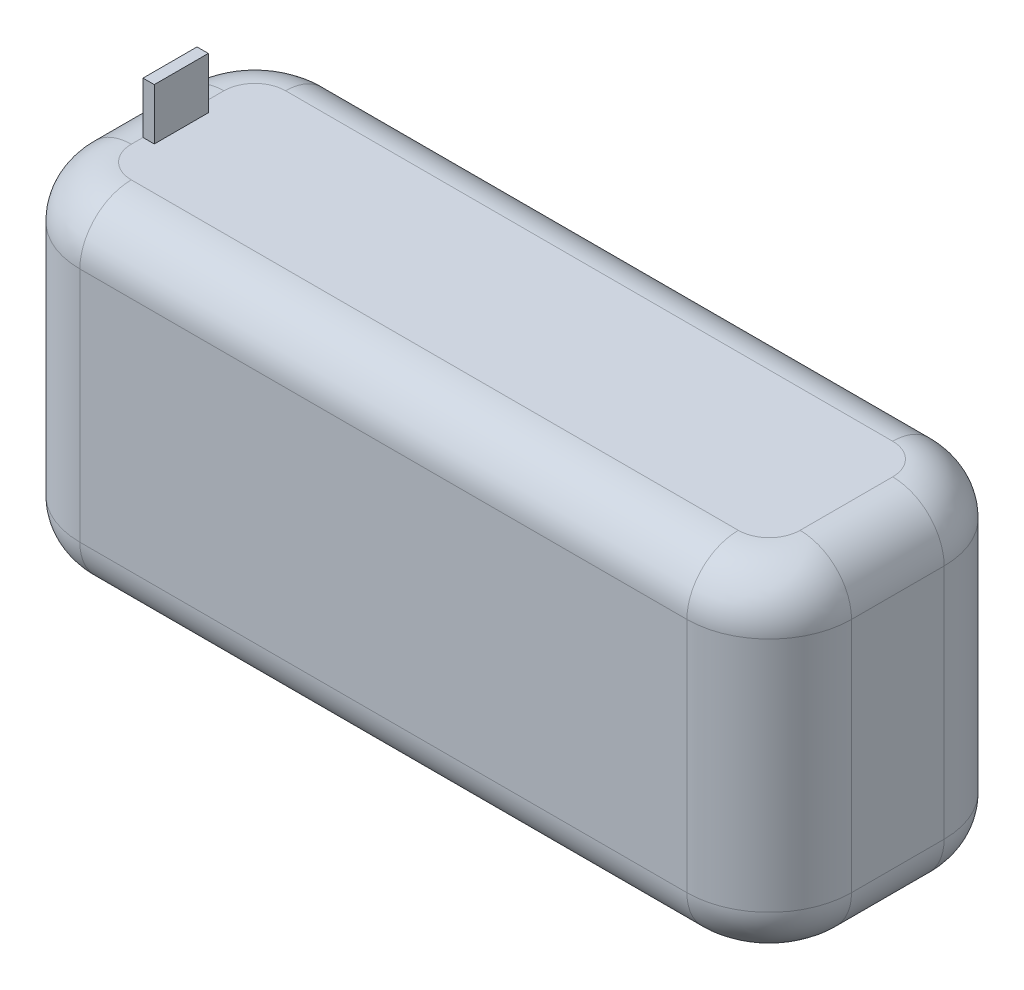
ISO-10303-21;
HEADER;
FILE_DESCRIPTION(('STEP AP214'),'2;1');
FILE_NAME('part.step','',(''),(''),'','','');
FILE_SCHEMA(('AUTOMOTIVE_DESIGN { 1 0 10303 214 1 1 1 1 }'));
ENDSEC;
DATA;
#1=APPLICATION_CONTEXT('core data for automotive mechanical design processes');
#2=APPLICATION_PROTOCOL_DEFINITION('international standard','automotive_design',2000,#1);
#3=PRODUCT_CONTEXT('',#1,'mechanical');
#4=PRODUCT('Part','Part','',(#3));
#5=PRODUCT_RELATED_PRODUCT_CATEGORY('part','',(#4));
#6=PRODUCT_DEFINITION_FORMATION('','',#4);
#7=PRODUCT_DEFINITION_CONTEXT('part definition',#1,'design');
#8=PRODUCT_DEFINITION('design','',#6,#7);
#9=PRODUCT_DEFINITION_SHAPE('','',#8);
#10=(LENGTH_UNIT() NAMED_UNIT(*) SI_UNIT(.MILLI.,.METRE.));
#11=(NAMED_UNIT(*) PLANE_ANGLE_UNIT() SI_UNIT($,.RADIAN.));
#12=(NAMED_UNIT(*) SI_UNIT($,.STERADIAN.) SOLID_ANGLE_UNIT());
#13=UNCERTAINTY_MEASURE_WITH_UNIT(LENGTH_MEASURE(1.E-05),#10,'distance_accuracy_value','');
#14=(GEOMETRIC_REPRESENTATION_CONTEXT(3) GLOBAL_UNCERTAINTY_ASSIGNED_CONTEXT((#13)) GLOBAL_UNIT_ASSIGNED_CONTEXT((#10,
#11,#12)) REPRESENTATION_CONTEXT('',''));
#15=CARTESIAN_POINT('',(0.,0.,0.));
#16=DIRECTION('',(0.,0.,1.));
#17=DIRECTION('',(1.,0.,0.));
#18=AXIS2_PLACEMENT_3D('',#15,#16,#17);
#19=CARTESIAN_POINT('',(-37.5,16.5,25.));
#20=DIRECTION('',(0.,-1.,0.));
#21=DIRECTION('',(0.,0.,-1.));
#22=AXIS2_PLACEMENT_3D('',#19,#20,#21);
#23=PLANE('',#22);
#24=DIRECTION('',(1.,0.,0.));
#25=VECTOR('',#24,1.);
#26=CARTESIAN_POINT('',(-32.5,16.5,15.8667271653457));
#27=LINE('',#26,#25);
#28=CARTESIAN_POINT('',(-32.5,16.5,15.8667271653457));
#29=VERTEX_POINT('',#28);
#30=CARTESIAN_POINT('',(-31.4033614629352,16.5,15.8667271653457));
#31=VERTEX_POINT('',#30);
#32=EDGE_CURVE('E849',#29,#31,#27,.T.);
#33=ORIENTED_EDGE('',*,*,#32,.F.);
#34=DIRECTION('',(0.,0.,-1.));
#35=VECTOR('',#34,1.);
#36=CARTESIAN_POINT('',(-32.5,16.5,25.));
#37=LINE('',#36,#35);
#38=CARTESIAN_POINT('',(-32.5,16.5,17.));
#39=VERTEX_POINT('',#38);
#40=EDGE_CURVE('E269',#29,#39,#37,.F.);
#41=ORIENTED_EDGE('',*,*,#40,.T.);
#42=CARTESIAN_POINT('',(-29.5,16.5,17.));
#43=DIRECTION('',(0.,-1.,0.));
#44=DIRECTION('',(0.,0.,-1.));
#45=AXIS2_PLACEMENT_3D('',#42,#43,#44);
#46=CIRCLE('',#45,3.);
#47=CARTESIAN_POINT('',(-29.5,16.5,20.));
#48=VERTEX_POINT('',#47);
#49=EDGE_CURVE('E346',#48,#39,#46,.T.);
#50=ORIENTED_EDGE('',*,*,#49,.F.);
#51=DIRECTION('',(-1.,0.,0.));
#52=VECTOR('',#51,1.);
#53=CARTESIAN_POINT('',(-37.5,16.5,20.));
#54=LINE('',#53,#52);
#55=CARTESIAN_POINT('',(29.5,16.5,20.));
#56=VERTEX_POINT('',#55);
#57=EDGE_CURVE('E266',#48,#56,#54,.F.);
#58=ORIENTED_EDGE('',*,*,#57,.T.);
#59=CARTESIAN_POINT('',(29.5,16.5,17.));
#60=DIRECTION('',(0.,-1.,0.));
#61=DIRECTION('',(0.,0.,-1.));
#62=AXIS2_PLACEMENT_3D('',#59,#60,#61);
#63=CIRCLE('',#62,3.);
#64=CARTESIAN_POINT('',(32.5,16.5,17.));
#65=VERTEX_POINT('',#64);
#66=EDGE_CURVE('E338',#65,#56,#63,.T.);
#67=ORIENTED_EDGE('',*,*,#66,.F.);
#68=DIRECTION('',(0.,0.,-1.));
#69=VECTOR('',#68,1.);
#70=CARTESIAN_POINT('',(32.5,16.5,25.));
#71=LINE('',#70,#69);
#72=CARTESIAN_POINT('',(32.5,16.5,8.));
#73=VERTEX_POINT('',#72);
#74=EDGE_CURVE('E273',#65,#73,#71,.T.);
#75=ORIENTED_EDGE('',*,*,#74,.T.);
#76=CARTESIAN_POINT('',(29.5,16.5,8.));
#77=DIRECTION('',(0.,-1.,0.));
#78=DIRECTION('',(0.,0.,-1.));
#79=AXIS2_PLACEMENT_3D('',#76,#77,#78);
#80=CIRCLE('',#79,3.);
#81=CARTESIAN_POINT('',(29.5,16.5,5.));
#82=VERTEX_POINT('',#81);
#83=EDGE_CURVE('E340',#82,#73,#80,.T.);
#84=ORIENTED_EDGE('',*,*,#83,.F.);
#85=DIRECTION('',(-1.,0.,0.));
#86=VECTOR('',#85,1.);
#87=CARTESIAN_POINT('',(-37.5,16.5,5.));
#88=LINE('',#87,#86);
#89=CARTESIAN_POINT('',(-29.5,16.5,5.));
#90=VERTEX_POINT('',#89);
#91=EDGE_CURVE('E276',#82,#90,#88,.T.);
#92=ORIENTED_EDGE('',*,*,#91,.T.);
#93=CARTESIAN_POINT('',(-29.5,16.5,8.));
#94=DIRECTION('',(0.,-1.,0.));
#95=DIRECTION('',(0.,0.,-1.));
#96=AXIS2_PLACEMENT_3D('',#93,#94,#95);
#97=CIRCLE('',#96,3.);
#98=CARTESIAN_POINT('',(-32.5,16.5,8.));
#99=VERTEX_POINT('',#98);
#100=EDGE_CURVE('E343',#99,#90,#97,.T.);
#101=ORIENTED_EDGE('',*,*,#100,.F.);
#102=CARTESIAN_POINT('',(-32.5,16.5,10.615074447756));
#103=VERTEX_POINT('',#102);
#104=EDGE_CURVE('E271',#99,#103,#37,.F.);
#105=ORIENTED_EDGE('',*,*,#104,.T.);
#106=DIRECTION('',(-1.,0.,0.));
#107=VECTOR('',#106,1.);
#108=CARTESIAN_POINT('',(-32.5,16.5,10.615074447756));
#109=LINE('',#108,#107);
#110=CARTESIAN_POINT('',(-31.4033614629352,16.5,10.615074447756));
#111=VERTEX_POINT('',#110);
#112=EDGE_CURVE('E57',#111,#103,#109,.T.);
#113=ORIENTED_EDGE('',*,*,#112,.F.);
#114=DIRECTION('',(0.,0.,-1.));
#115=VECTOR('',#114,1.);
#116=CARTESIAN_POINT('',(-31.4033614629352,16.5,10.615074447756));
#117=LINE('',#116,#115);
#118=EDGE_CURVE('E52',#31,#111,#117,.T.);
#119=ORIENTED_EDGE('',*,*,#118,.F.);
#120=EDGE_LOOP('',(#33,#41,#50,#58,#67,#75,#84,#92,#101,#105,#113,#119));
#121=FACE_BOUND('',#120,.T.);
#122=ADVANCED_FACE('F35',(#121),#23,.F.);
#123=CARTESIAN_POINT('',(-37.5,-16.5,25.));
#124=DIRECTION('',(0.,1.,0.));
#125=DIRECTION('',(0.,0.,1.));
#126=AXIS2_PLACEMENT_3D('',#123,#124,#125);
#127=PLANE('',#126);
#128=DIRECTION('',(-1.,0.,0.));
#129=VECTOR('',#128,1.);
#130=CARTESIAN_POINT('',(-33.776709246427,-16.5,15.316188936076));
#131=LINE('',#130,#129);
#132=CARTESIAN_POINT('',(-31.223290753573,-16.5,15.316188936076));
#133=VERTEX_POINT('',#132);
#134=CARTESIAN_POINT('',(-32.5,-16.5,15.316188936076));
#135=VERTEX_POINT('',#134);
#136=EDGE_CURVE('E246',#133,#135,#131,.T.);
#137=ORIENTED_EDGE('',*,*,#136,.F.);
#138=DIRECTION('',(0.,0.,1.));
#139=VECTOR('',#138,1.);
#140=CARTESIAN_POINT('',(-31.223290753573,-16.5,9.683811063924));
#141=LINE('',#140,#139);
#142=CARTESIAN_POINT('',(-31.223290753573,-16.5,9.683811063924));
#143=VERTEX_POINT('',#142);
#144=EDGE_CURVE('E226',#143,#133,#141,.T.);
#145=ORIENTED_EDGE('',*,*,#144,.F.);
#146=DIRECTION('',(1.,0.,0.));
#147=VECTOR('',#146,1.);
#148=CARTESIAN_POINT('',(-33.776709246427,-16.5,9.683811063924));
#149=LINE('',#148,#147);
#150=CARTESIAN_POINT('',(-32.5,-16.5,9.683811063924));
#151=VERTEX_POINT('',#150);
#152=EDGE_CURVE('E251',#151,#143,#149,.T.);
#153=ORIENTED_EDGE('',*,*,#152,.F.);
#154=DIRECTION('',(0.,0.,-1.));
#155=VECTOR('',#154,1.);
#156=CARTESIAN_POINT('',(-32.5,-16.5,25.));
#157=LINE('',#156,#155);
#158=CARTESIAN_POINT('',(-32.5,-16.5,8.));
#159=VERTEX_POINT('',#158);
#160=EDGE_CURVE('E288',#151,#159,#157,.T.);
#161=ORIENTED_EDGE('',*,*,#160,.T.);
#162=CARTESIAN_POINT('',(-29.5,-16.5,8.));
#163=DIRECTION('',(0.,1.,0.));
#164=DIRECTION('',(0.,0.,1.));
#165=AXIS2_PLACEMENT_3D('',#162,#163,#164);
#166=CIRCLE('',#165,3.);
#167=CARTESIAN_POINT('',(-29.5,-16.5,5.));
#168=VERTEX_POINT('',#167);
#169=EDGE_CURVE('E323',#168,#159,#166,.T.);
#170=ORIENTED_EDGE('',*,*,#169,.F.);
#171=DIRECTION('',(1.,0.,0.));
#172=VECTOR('',#171,1.);
#173=CARTESIAN_POINT('',(37.5,-16.5,5.));
#174=LINE('',#173,#172);
#175=CARTESIAN_POINT('',(29.5,-16.5,5.));
#176=VERTEX_POINT('',#175);
#177=EDGE_CURVE('E296',#168,#176,#174,.T.);
#178=ORIENTED_EDGE('',*,*,#177,.T.);
#179=CARTESIAN_POINT('',(29.5,-16.5,8.));
#180=DIRECTION('',(0.,1.,0.));
#181=DIRECTION('',(0.,0.,1.));
#182=AXIS2_PLACEMENT_3D('',#179,#180,#181);
#183=CIRCLE('',#182,3.);
#184=CARTESIAN_POINT('',(32.5,-16.5,8.));
#185=VERTEX_POINT('',#184);
#186=EDGE_CURVE('E320',#185,#176,#183,.T.);
#187=ORIENTED_EDGE('',*,*,#186,.F.);
#188=DIRECTION('',(0.,0.,-1.));
#189=VECTOR('',#188,1.);
#190=CARTESIAN_POINT('',(32.5,-16.5,25.));
#191=LINE('',#190,#189);
#192=CARTESIAN_POINT('',(32.5,-16.5,17.));
#193=VERTEX_POINT('',#192);
#194=EDGE_CURVE('E292',#185,#193,#191,.F.);
#195=ORIENTED_EDGE('',*,*,#194,.T.);
#196=CARTESIAN_POINT('',(29.5,-16.5,17.));
#197=DIRECTION('',(0.,1.,0.));
#198=DIRECTION('',(0.,0.,1.));
#199=AXIS2_PLACEMENT_3D('',#196,#197,#198);
#200=CIRCLE('',#199,3.);
#201=CARTESIAN_POINT('',(29.5,-16.5,20.));
#202=VERTEX_POINT('',#201);
#203=EDGE_CURVE('E317',#202,#193,#200,.T.);
#204=ORIENTED_EDGE('',*,*,#203,.F.);
#205=DIRECTION('',(1.,0.,0.));
#206=VECTOR('',#205,1.);
#207=CARTESIAN_POINT('',(-37.5,-16.5,20.));
#208=LINE('',#207,#206);
#209=CARTESIAN_POINT('',(-29.5,-16.5,20.));
#210=VERTEX_POINT('',#209);
#211=EDGE_CURVE('E285',#202,#210,#208,.F.);
#212=ORIENTED_EDGE('',*,*,#211,.T.);
#213=CARTESIAN_POINT('',(-29.5,-16.5,17.));
#214=DIRECTION('',(0.,1.,0.));
#215=DIRECTION('',(0.,0.,1.));
#216=AXIS2_PLACEMENT_3D('',#213,#214,#215);
#217=CIRCLE('',#216,3.);
#218=CARTESIAN_POINT('',(-32.5,-16.5,17.));
#219=VERTEX_POINT('',#218);
#220=EDGE_CURVE('E326',#219,#210,#217,.T.);
#221=ORIENTED_EDGE('',*,*,#220,.F.);
#222=EDGE_CURVE('E289',#219,#135,#157,.T.);
#223=ORIENTED_EDGE('',*,*,#222,.T.);
#224=EDGE_LOOP('',(#137,#145,#153,#161,#170,#178,#187,#195,#204,#212,#221,#223));
#225=FACE_BOUND('',#224,.T.);
#226=ADVANCED_FACE('F424',(#225),#127,.F.);
#227=CARTESIAN_POINT('',(37.5,-16.5,25.));
#228=DIRECTION('',(-1.,0.,0.));
#229=DIRECTION('',(0.,0.,1.));
#230=AXIS2_PLACEMENT_3D('',#227,#228,#229);
#231=PLANE('',#230);
#232=DIRECTION('',(0.,0.,-1.));
#233=VECTOR('',#232,1.);
#234=CARTESIAN_POINT('',(37.5,11.5,25.));
#235=LINE('',#234,#233);
#236=CARTESIAN_POINT('',(37.5,11.5,8.));
#237=VERTEX_POINT('',#236);
#238=CARTESIAN_POINT('',(37.5,11.5,17.));
#239=VERTEX_POINT('',#238);
#240=EDGE_CURVE('E282',#237,#239,#235,.F.);
#241=ORIENTED_EDGE('',*,*,#240,.T.);
#242=DIRECTION('',(0.,1.,0.));
#243=VECTOR('',#242,1.);
#244=CARTESIAN_POINT('',(37.5,-16.5,17.));
#245=LINE('',#244,#243);
#246=CARTESIAN_POINT('',(37.5,-11.5,17.));
#247=VERTEX_POINT('',#246);
#248=EDGE_CURVE('E381',#239,#247,#245,.F.);
#249=ORIENTED_EDGE('',*,*,#248,.T.);
#250=DIRECTION('',(0.,0.,-1.));
#251=VECTOR('',#250,1.);
#252=CARTESIAN_POINT('',(37.5,-11.5,25.));
#253=LINE('',#252,#251);
#254=CARTESIAN_POINT('',(37.5,-11.5,8.));
#255=VERTEX_POINT('',#254);
#256=EDGE_CURVE('E279',#247,#255,#253,.T.);
#257=ORIENTED_EDGE('',*,*,#256,.T.);
#258=DIRECTION('',(0.,1.,0.));
#259=VECTOR('',#258,1.);
#260=CARTESIAN_POINT('',(37.5,11.5,8.));
#261=LINE('',#260,#259);
#262=EDGE_CURVE('E379',#255,#237,#261,.T.);
#263=ORIENTED_EDGE('',*,*,#262,.T.);
#264=EDGE_LOOP('',(#241,#249,#257,#263));
#265=FACE_BOUND('',#264,.T.);
#266=ADVANCED_FACE('F433',(#265),#231,.F.);
#267=CARTESIAN_POINT('',(-37.5,-16.5,25.));
#268=DIRECTION('',(1.,0.,0.));
#269=DIRECTION('',(0.,0.,-1.));
#270=AXIS2_PLACEMENT_3D('',#267,#268,#269);
#271=PLANE('',#270);
#272=DIRECTION('',(0.,0.,-1.));
#273=VECTOR('',#272,1.);
#274=CARTESIAN_POINT('',(-37.5,11.5,25.));
#275=LINE('',#274,#273);
#276=CARTESIAN_POINT('',(-37.5,11.5,17.));
#277=VERTEX_POINT('',#276);
#278=CARTESIAN_POINT('',(-37.5,11.5,8.));
#279=VERTEX_POINT('',#278);
#280=EDGE_CURVE('E302',#277,#279,#275,.T.);
#281=ORIENTED_EDGE('',*,*,#280,.T.);
#282=DIRECTION('',(0.,-1.,0.));
#283=VECTOR('',#282,1.);
#284=CARTESIAN_POINT('',(-37.5,-11.5,8.));
#285=LINE('',#284,#283);
#286=CARTESIAN_POINT('',(-37.5,-11.5,8.));
#287=VERTEX_POINT('',#286);
#288=EDGE_CURVE('E11',#279,#287,#285,.T.);
#289=ORIENTED_EDGE('',*,*,#288,.T.);
#290=DIRECTION('',(0.,0.,-1.));
#291=VECTOR('',#290,1.);
#292=CARTESIAN_POINT('',(-37.5,-11.5,25.));
#293=LINE('',#292,#291);
#294=CARTESIAN_POINT('',(-37.5,-11.5,17.));
#295=VERTEX_POINT('',#294);
#296=EDGE_CURVE('E299',#287,#295,#293,.F.);
#297=ORIENTED_EDGE('',*,*,#296,.T.);
#298=DIRECTION('',(0.,-1.,0.));
#299=VECTOR('',#298,1.);
#300=CARTESIAN_POINT('',(-37.5,-16.5,17.));
#301=LINE('',#300,#299);
#302=EDGE_CURVE('E44',#295,#277,#301,.F.);
#303=ORIENTED_EDGE('',*,*,#302,.T.);
#304=EDGE_LOOP('',(#281,#289,#297,#303));
#305=FACE_BOUND('',#304,.T.);
#306=ADVANCED_FACE('F463',(#305),#271,.F.);
#307=CARTESIAN_POINT('',(0.,0.,25.));
#308=DIRECTION('',(0.,0.,-1.));
#309=DIRECTION('',(-1.,0.,0.));
#310=AXIS2_PLACEMENT_3D('',#307,#308,#309);
#311=PLANE('',#310);
#312=DIRECTION('',(1.,0.,0.));
#313=VECTOR('',#312,1.);
#314=CARTESIAN_POINT('',(0.,-11.5,25.));
#315=LINE('',#314,#313);
#316=CARTESIAN_POINT('',(-29.5,-11.5,25.));
#317=VERTEX_POINT('',#316);
#318=CARTESIAN_POINT('',(29.5,-11.5,25.));
#319=VERTEX_POINT('',#318);
#320=EDGE_CURVE('E314',#317,#319,#315,.T.);
#321=ORIENTED_EDGE('',*,*,#320,.T.);
#322=DIRECTION('',(0.,1.,0.));
#323=VECTOR('',#322,1.);
#324=CARTESIAN_POINT('',(29.5,0.,25.));
#325=LINE('',#324,#323);
#326=CARTESIAN_POINT('',(29.5,11.5,25.));
#327=VERTEX_POINT('',#326);
#328=EDGE_CURVE('E377',#319,#327,#325,.T.);
#329=ORIENTED_EDGE('',*,*,#328,.T.);
#330=DIRECTION('',(-1.,0.,0.));
#331=VECTOR('',#330,1.);
#332=CARTESIAN_POINT('',(0.,11.5,25.));
#333=LINE('',#332,#331);
#334=CARTESIAN_POINT('',(-29.5,11.5,25.));
#335=VERTEX_POINT('',#334);
#336=EDGE_CURVE('E311',#327,#335,#333,.T.);
#337=ORIENTED_EDGE('',*,*,#336,.T.);
#338=DIRECTION('',(0.,-1.,0.));
#339=VECTOR('',#338,1.);
#340=CARTESIAN_POINT('',(-29.5,0.,25.));
#341=LINE('',#340,#339);
#342=EDGE_CURVE('E375',#335,#317,#341,.T.);
#343=ORIENTED_EDGE('',*,*,#342,.T.);
#344=EDGE_LOOP('',(#321,#329,#337,#343));
#345=FACE_BOUND('',#344,.T.);
#346=ADVANCED_FACE('F696',(#345),#311,.F.);
#347=CARTESIAN_POINT('',(0.,0.,0.));
#348=DIRECTION('',(0.,0.,-1.));
#349=DIRECTION('',(-1.,0.,0.));
#350=AXIS2_PLACEMENT_3D('',#347,#348,#349);
#351=PLANE('',#350);
#352=DIRECTION('',(-1.,0.,0.));
#353=VECTOR('',#352,1.);
#354=CARTESIAN_POINT('',(37.5,11.5,0.));
#355=LINE('',#354,#353);
#356=CARTESIAN_POINT('',(-29.5,11.5,0.));
#357=VERTEX_POINT('',#356);
#358=CARTESIAN_POINT('',(29.5,11.5,0.));
#359=VERTEX_POINT('',#358);
#360=EDGE_CURVE('E305',#357,#359,#355,.F.);
#361=ORIENTED_EDGE('',*,*,#360,.T.);
#362=DIRECTION('',(0.,1.,0.));
#363=VECTOR('',#362,1.);
#364=CARTESIAN_POINT('',(29.5,-11.5,0.));
#365=LINE('',#364,#363);
#366=CARTESIAN_POINT('',(29.5,-11.5,0.));
#367=VERTEX_POINT('',#366);
#368=EDGE_CURVE('E385',#359,#367,#365,.F.);
#369=ORIENTED_EDGE('',*,*,#368,.T.);
#370=DIRECTION('',(1.,0.,0.));
#371=VECTOR('',#370,1.);
#372=CARTESIAN_POINT('',(-37.5,-11.5,0.));
#373=LINE('',#372,#371);
#374=CARTESIAN_POINT('',(-29.5,-11.5,0.));
#375=VERTEX_POINT('',#374);
#376=EDGE_CURVE('E308',#367,#375,#373,.F.);
#377=ORIENTED_EDGE('',*,*,#376,.T.);
#378=DIRECTION('',(0.,-1.,0.));
#379=VECTOR('',#378,1.);
#380=CARTESIAN_POINT('',(-29.5,11.5,0.));
#381=LINE('',#380,#379);
#382=EDGE_CURVE('E383',#375,#357,#381,.F.);
#383=ORIENTED_EDGE('',*,*,#382,.T.);
#384=EDGE_LOOP('',(#361,#369,#377,#383));
#385=FACE_BOUND('',#384,.T.);
#386=ADVANCED_FACE('F526',(#385),#351,.T.);
#387=CARTESIAN_POINT('',(-32.5,11.5,25.));
#388=DIRECTION('',(0.,0.,-1.));
#389=DIRECTION('',(-1.,0.,0.));
#390=AXIS2_PLACEMENT_3D('',#387,#388,#389);
#391=CYLINDRICAL_SURFACE('',#390,5.);
#392=ORIENTED_EDGE('',*,*,#280,.F.);
#393=CARTESIAN_POINT('',(-32.5,11.5,17.));
#394=DIRECTION('',(0.,0.,-1.));
#395=DIRECTION('',(-1.,0.,0.));
#396=AXIS2_PLACEMENT_3D('',#393,#394,#395);
#397=CIRCLE('',#396,5.);
#398=EDGE_CURVE('E335',#277,#39,#397,.T.);
#399=ORIENTED_EDGE('',*,*,#398,.T.);
#400=ORIENTED_EDGE('',*,*,#40,.F.);
#401=DIRECTION('',(0.,0.,1.));
#402=VECTOR('',#401,1.);
#403=CARTESIAN_POINT('',(-32.5,16.5,10.615074447756));
#404=LINE('',#403,#402);
#405=EDGE_CURVE('E225',#103,#29,#404,.T.);
#406=ORIENTED_EDGE('',*,*,#405,.F.);
#407=ORIENTED_EDGE('',*,*,#104,.F.);
#408=CARTESIAN_POINT('',(-32.5,11.5,8.));
#409=DIRECTION('',(0.,0.,1.));
#410=DIRECTION('',(1.,0.,0.));
#411=AXIS2_PLACEMENT_3D('',#408,#409,#410);
#412=CIRCLE('',#411,5.);
#413=EDGE_CURVE('E333',#99,#279,#412,.T.);
#414=ORIENTED_EDGE('',*,*,#413,.T.);
#415=EDGE_LOOP('',(#392,#399,#400,#406,#407,#414));
#416=FACE_BOUND('',#415,.T.);
#417=ADVANCED_FACE('F485',(#416),#391,.T.);
#418=CARTESIAN_POINT('',(0.,11.5,20.));
#419=DIRECTION('',(-1.,0.,0.));
#420=DIRECTION('',(0.,0.,1.));
#421=AXIS2_PLACEMENT_3D('',#418,#419,#420);
#422=CYLINDRICAL_SURFACE('',#421,5.);
#423=ORIENTED_EDGE('',*,*,#336,.F.);
#424=CARTESIAN_POINT('',(29.5,11.5,20.));
#425=DIRECTION('',(-1.,0.,0.));
#426=DIRECTION('',(0.,0.,1.));
#427=AXIS2_PLACEMENT_3D('',#424,#425,#426);
#428=CIRCLE('',#427,5.);
#429=EDGE_CURVE('E368',#327,#56,#428,.T.);
#430=ORIENTED_EDGE('',*,*,#429,.T.);
#431=ORIENTED_EDGE('',*,*,#57,.F.);
#432=CARTESIAN_POINT('',(-29.5,11.5,20.));
#433=DIRECTION('',(1.,0.,0.));
#434=DIRECTION('',(0.,0.,-1.));
#435=AXIS2_PLACEMENT_3D('',#432,#433,#434);
#436=CIRCLE('',#435,5.);
#437=EDGE_CURVE('E366',#48,#335,#436,.T.);
#438=ORIENTED_EDGE('',*,*,#437,.T.);
#439=EDGE_LOOP('',(#423,#430,#431,#438));
#440=FACE_BOUND('',#439,.T.);
#441=ADVANCED_FACE('F493',(#440),#422,.T.);
#442=CARTESIAN_POINT('',(-37.5,11.5,5.));
#443=DIRECTION('',(1.,0.,0.));
#444=DIRECTION('',(0.,0.,-1.));
#445=AXIS2_PLACEMENT_3D('',#442,#443,#444);
#446=CYLINDRICAL_SURFACE('',#445,5.);
#447=ORIENTED_EDGE('',*,*,#360,.F.);
#448=CARTESIAN_POINT('',(-29.5,11.5,5.));
#449=DIRECTION('',(1.,0.,0.));
#450=DIRECTION('',(0.,0.,-1.));
#451=AXIS2_PLACEMENT_3D('',#448,#449,#450);
#452=CIRCLE('',#451,5.);
#453=EDGE_CURVE('E356',#357,#90,#452,.T.);
#454=ORIENTED_EDGE('',*,*,#453,.T.);
#455=ORIENTED_EDGE('',*,*,#91,.F.);
#456=CARTESIAN_POINT('',(29.5,11.5,5.));
#457=DIRECTION('',(-1.,0.,0.));
#458=DIRECTION('',(0.,0.,1.));
#459=AXIS2_PLACEMENT_3D('',#456,#457,#458);
#460=CIRCLE('',#459,5.);
#461=EDGE_CURVE('E354',#82,#359,#460,.T.);
#462=ORIENTED_EDGE('',*,*,#461,.T.);
#463=EDGE_LOOP('',(#447,#454,#455,#462));
#464=FACE_BOUND('',#463,.T.);
#465=ADVANCED_FACE('F449',(#464),#446,.T.);
#466=CARTESIAN_POINT('',(32.5,11.5,25.));
#467=DIRECTION('',(0.,0.,-1.));
#468=DIRECTION('',(-1.,0.,0.));
#469=AXIS2_PLACEMENT_3D('',#466,#467,#468);
#470=CYLINDRICAL_SURFACE('',#469,5.);
#471=ORIENTED_EDGE('',*,*,#240,.F.);
#472=CARTESIAN_POINT('',(32.5,11.5,8.));
#473=DIRECTION('',(0.,0.,1.));
#474=DIRECTION('',(1.,0.,0.));
#475=AXIS2_PLACEMENT_3D('',#472,#473,#474);
#476=CIRCLE('',#475,5.);
#477=EDGE_CURVE('E360',#237,#73,#476,.T.);
#478=ORIENTED_EDGE('',*,*,#477,.T.);
#479=ORIENTED_EDGE('',*,*,#74,.F.);
#480=CARTESIAN_POINT('',(32.5,11.5,17.));
#481=DIRECTION('',(0.,0.,-1.));
#482=DIRECTION('',(-1.,0.,0.));
#483=AXIS2_PLACEMENT_3D('',#480,#481,#482);
#484=CIRCLE('',#483,5.);
#485=EDGE_CURVE('E358',#65,#239,#484,.T.);
#486=ORIENTED_EDGE('',*,*,#485,.T.);
#487=EDGE_LOOP('',(#471,#478,#479,#486));
#488=FACE_BOUND('',#487,.T.);
#489=ADVANCED_FACE('F437',(#488),#470,.T.);
#490=CARTESIAN_POINT('',(-32.5,-11.5,25.));
#491=DIRECTION('',(0.,0.,-1.));
#492=DIRECTION('',(-1.,0.,0.));
#493=AXIS2_PLACEMENT_3D('',#490,#491,#492);
#494=CYLINDRICAL_SURFACE('',#493,5.);
#495=ORIENTED_EDGE('',*,*,#296,.F.);
#496=CARTESIAN_POINT('',(-32.5,-11.5,8.));
#497=DIRECTION('',(0.,0.,1.));
#498=DIRECTION('',(1.,0.,0.));
#499=AXIS2_PLACEMENT_3D('',#496,#497,#498);
#500=CIRCLE('',#499,5.);
#501=EDGE_CURVE('E351',#287,#159,#500,.T.);
#502=ORIENTED_EDGE('',*,*,#501,.T.);
#503=ORIENTED_EDGE('',*,*,#160,.F.);
#504=EDGE_CURVE('E293',#135,#151,#157,.T.);
#505=ORIENTED_EDGE('',*,*,#504,.F.);
#506=ORIENTED_EDGE('',*,*,#222,.F.);
#507=CARTESIAN_POINT('',(-32.5,-11.5,17.));
#508=DIRECTION('',(0.,0.,-1.));
#509=DIRECTION('',(-1.,0.,0.));
#510=AXIS2_PLACEMENT_3D('',#507,#508,#509);
#511=CIRCLE('',#510,5.);
#512=EDGE_CURVE('E349',#219,#295,#511,.T.);
#513=ORIENTED_EDGE('',*,*,#512,.T.);
#514=EDGE_LOOP('',(#495,#502,#503,#505,#506,#513));
#515=FACE_BOUND('',#514,.T.);
#516=ADVANCED_FACE('F467',(#515),#494,.T.);
#517=CARTESIAN_POINT('',(0.,-11.5,20.));
#518=DIRECTION('',(1.,0.,0.));
#519=DIRECTION('',(0.,0.,-1.));
#520=AXIS2_PLACEMENT_3D('',#517,#518,#519);
#521=CYLINDRICAL_SURFACE('',#520,5.);
#522=ORIENTED_EDGE('',*,*,#320,.F.);
#523=CARTESIAN_POINT('',(-29.5,-11.5,20.));
#524=DIRECTION('',(1.,0.,0.));
#525=DIRECTION('',(0.,0.,-1.));
#526=AXIS2_PLACEMENT_3D('',#523,#524,#525);
#527=CIRCLE('',#526,5.);
#528=EDGE_CURVE('E331',#317,#210,#527,.T.);
#529=ORIENTED_EDGE('',*,*,#528,.T.);
#530=ORIENTED_EDGE('',*,*,#211,.F.);
#531=CARTESIAN_POINT('',(29.5,-11.5,20.));
#532=DIRECTION('',(-1.,0.,0.));
#533=DIRECTION('',(0.,0.,1.));
#534=AXIS2_PLACEMENT_3D('',#531,#532,#533);
#535=CIRCLE('',#534,5.);
#536=EDGE_CURVE('E329',#202,#319,#535,.T.);
#537=ORIENTED_EDGE('',*,*,#536,.T.);
#538=EDGE_LOOP('',(#522,#529,#530,#537));
#539=FACE_BOUND('',#538,.T.);
#540=ADVANCED_FACE('F477',(#539),#521,.T.);
#541=CARTESIAN_POINT('',(-37.5,-11.5,5.));
#542=DIRECTION('',(-1.,0.,0.));
#543=DIRECTION('',(0.,0.,1.));
#544=AXIS2_PLACEMENT_3D('',#541,#542,#543);
#545=CYLINDRICAL_SURFACE('',#544,5.);
#546=ORIENTED_EDGE('',*,*,#376,.F.);
#547=CARTESIAN_POINT('',(29.5,-11.5,5.));
#548=DIRECTION('',(-1.,0.,0.));
#549=DIRECTION('',(0.,0.,1.));
#550=AXIS2_PLACEMENT_3D('',#547,#548,#549);
#551=CIRCLE('',#550,5.);
#552=EDGE_CURVE('E364',#367,#176,#551,.T.);
#553=ORIENTED_EDGE('',*,*,#552,.T.);
#554=ORIENTED_EDGE('',*,*,#177,.F.);
#555=CARTESIAN_POINT('',(-29.5,-11.5,5.));
#556=DIRECTION('',(1.,0.,0.));
#557=DIRECTION('',(0.,0.,-1.));
#558=AXIS2_PLACEMENT_3D('',#555,#556,#557);
#559=CIRCLE('',#558,5.);
#560=EDGE_CURVE('E362',#168,#375,#559,.T.);
#561=ORIENTED_EDGE('',*,*,#560,.T.);
#562=EDGE_LOOP('',(#546,#553,#554,#561));
#563=FACE_BOUND('',#562,.T.);
#564=ADVANCED_FACE('F529',(#563),#545,.T.);
#565=CARTESIAN_POINT('',(32.5,-11.5,25.));
#566=DIRECTION('',(0.,0.,-1.));
#567=DIRECTION('',(-1.,0.,0.));
#568=AXIS2_PLACEMENT_3D('',#565,#566,#567);
#569=CYLINDRICAL_SURFACE('',#568,5.);
#570=ORIENTED_EDGE('',*,*,#256,.F.);
#571=CARTESIAN_POINT('',(32.5,-11.5,17.));
#572=DIRECTION('',(0.,0.,-1.));
#573=DIRECTION('',(-1.,0.,0.));
#574=AXIS2_PLACEMENT_3D('',#571,#572,#573);
#575=CIRCLE('',#574,5.);
#576=EDGE_CURVE('E373',#247,#193,#575,.T.);
#577=ORIENTED_EDGE('',*,*,#576,.T.);
#578=ORIENTED_EDGE('',*,*,#194,.F.);
#579=CARTESIAN_POINT('',(32.5,-11.5,8.));
#580=DIRECTION('',(0.,0.,1.));
#581=DIRECTION('',(1.,0.,0.));
#582=AXIS2_PLACEMENT_3D('',#579,#580,#581);
#583=CIRCLE('',#582,5.);
#584=EDGE_CURVE('E371',#185,#255,#583,.T.);
#585=ORIENTED_EDGE('',*,*,#584,.T.);
#586=EDGE_LOOP('',(#570,#577,#578,#585));
#587=FACE_BOUND('',#586,.T.);
#588=ADVANCED_FACE('F421',(#587),#569,.T.);
#589=CARTESIAN_POINT('',(-29.5,11.5,17.));
#590=DIRECTION('',(0.,-1.,0.));
#591=DIRECTION('',(0.,0.,-1.));
#592=AXIS2_PLACEMENT_3D('',#589,#590,#591);
#593=DEGENERATE_TOROIDAL_SURFACE('',#592,3.,5.,.T.);
#594=ORIENTED_EDGE('',*,*,#49,.T.);
#595=ORIENTED_EDGE('',*,*,#398,.F.);
#596=CARTESIAN_POINT('',(-29.5,11.5,17.));
#597=DIRECTION('',(0.,-1.,0.));
#598=DIRECTION('',(0.,0.,-1.));
#599=AXIS2_PLACEMENT_3D('',#596,#597,#598);
#600=CIRCLE('',#599,8.);
#601=EDGE_CURVE('E270',#335,#277,#600,.T.);
#602=ORIENTED_EDGE('',*,*,#601,.F.);
#603=ORIENTED_EDGE('',*,*,#437,.F.);
#604=EDGE_LOOP('',(#594,#595,#602,#603));
#605=FACE_BOUND('',#604,.T.);
#606=ADVANCED_FACE('F488',(#605),#593,.T.);
#607=CARTESIAN_POINT('',(-29.5,0.,17.));
#608=DIRECTION('',(0.,-1.,0.));
#609=DIRECTION('',(0.,0.,-1.));
#610=AXIS2_PLACEMENT_3D('',#607,#608,#609);
#611=CYLINDRICAL_SURFACE('',#610,8.);
#612=ORIENTED_EDGE('',*,*,#601,.T.);
#613=ORIENTED_EDGE('',*,*,#302,.F.);
#614=CARTESIAN_POINT('',(-29.5,-11.5,17.));
#615=DIRECTION('',(0.,1.,0.));
#616=DIRECTION('',(0.,0.,1.));
#617=AXIS2_PLACEMENT_3D('',#614,#615,#616);
#618=CIRCLE('',#617,8.);
#619=EDGE_CURVE('E388',#317,#295,#618,.F.);
#620=ORIENTED_EDGE('',*,*,#619,.F.);
#621=ORIENTED_EDGE('',*,*,#342,.F.);
#622=EDGE_LOOP('',(#612,#613,#620,#621));
#623=FACE_BOUND('',#622,.T.);
#624=ADVANCED_FACE('F481',(#623),#611,.T.);
#625=CARTESIAN_POINT('',(-29.5,-11.5,17.));
#626=DIRECTION('',(0.,1.,0.));
#627=DIRECTION('',(0.,0.,1.));
#628=AXIS2_PLACEMENT_3D('',#625,#626,#627);
#629=DEGENERATE_TOROIDAL_SURFACE('',#628,3.,5.,.T.);
#630=ORIENTED_EDGE('',*,*,#512,.F.);
#631=ORIENTED_EDGE('',*,*,#220,.T.);
#632=ORIENTED_EDGE('',*,*,#528,.F.);
#633=ORIENTED_EDGE('',*,*,#619,.T.);
#634=EDGE_LOOP('',(#630,#631,#632,#633));
#635=FACE_BOUND('',#634,.T.);
#636=ADVANCED_FACE('F471',(#635),#629,.T.);
#637=CARTESIAN_POINT('',(-29.5,11.5,8.));
#638=DIRECTION('',(0.,-1.,0.));
#639=DIRECTION('',(0.,0.,-1.));
#640=AXIS2_PLACEMENT_3D('',#637,#638,#639);
#641=DEGENERATE_TOROIDAL_SURFACE('',#640,3.,5.,.T.);
#642=ORIENTED_EDGE('',*,*,#100,.T.);
#643=ORIENTED_EDGE('',*,*,#453,.F.);
#644=CARTESIAN_POINT('',(-29.5,11.5,8.));
#645=DIRECTION('',(0.,-1.,0.));
#646=DIRECTION('',(0.,0.,-1.));
#647=AXIS2_PLACEMENT_3D('',#644,#645,#646);
#648=CIRCLE('',#647,8.);
#649=EDGE_CURVE('E391',#279,#357,#648,.T.);
#650=ORIENTED_EDGE('',*,*,#649,.F.);
#651=ORIENTED_EDGE('',*,*,#413,.F.);
#652=EDGE_LOOP('',(#642,#643,#650,#651));
#653=FACE_BOUND('',#652,.T.);
#654=ADVANCED_FACE('F453',(#653),#641,.T.);
#655=CARTESIAN_POINT('',(-29.5,-16.5,8.));
#656=DIRECTION('',(0.,1.,0.));
#657=DIRECTION('',(0.,0.,1.));
#658=AXIS2_PLACEMENT_3D('',#655,#656,#657);
#659=CYLINDRICAL_SURFACE('',#658,8.);
#660=ORIENTED_EDGE('',*,*,#649,.T.);
#661=ORIENTED_EDGE('',*,*,#382,.F.);
#662=CARTESIAN_POINT('',(-29.5,-11.5,8.));
#663=DIRECTION('',(0.,1.,0.));
#664=DIRECTION('',(0.,0.,1.));
#665=AXIS2_PLACEMENT_3D('',#662,#663,#664);
#666=CIRCLE('',#665,8.);
#667=EDGE_CURVE('E394',#287,#375,#666,.F.);
#668=ORIENTED_EDGE('',*,*,#667,.F.);
#669=ORIENTED_EDGE('',*,*,#288,.F.);
#670=EDGE_LOOP('',(#660,#661,#668,#669));
#671=FACE_BOUND('',#670,.T.);
#672=ADVANCED_FACE('F458',(#671),#659,.T.);
#673=CARTESIAN_POINT('',(-29.5,-11.5,8.));
#674=DIRECTION('',(0.,1.,0.));
#675=DIRECTION('',(0.,0.,1.));
#676=AXIS2_PLACEMENT_3D('',#673,#674,#675);
#677=DEGENERATE_TOROIDAL_SURFACE('',#676,3.,5.,.T.);
#678=ORIENTED_EDGE('',*,*,#501,.F.);
#679=ORIENTED_EDGE('',*,*,#667,.T.);
#680=ORIENTED_EDGE('',*,*,#560,.F.);
#681=ORIENTED_EDGE('',*,*,#169,.T.);
#682=EDGE_LOOP('',(#678,#679,#680,#681));
#683=FACE_BOUND('',#682,.T.);
#684=ADVANCED_FACE('F543',(#683),#677,.T.);
#685=CARTESIAN_POINT('',(29.5,-11.5,8.));
#686=DIRECTION('',(0.,1.,0.));
#687=DIRECTION('',(0.,0.,1.));
#688=AXIS2_PLACEMENT_3D('',#685,#686,#687);
#689=DEGENERATE_TOROIDAL_SURFACE('',#688,3.,5.,.T.);
#690=ORIENTED_EDGE('',*,*,#186,.T.);
#691=ORIENTED_EDGE('',*,*,#552,.F.);
#692=CARTESIAN_POINT('',(29.5,-11.5,8.));
#693=DIRECTION('',(0.,1.,0.));
#694=DIRECTION('',(0.,0.,1.));
#695=AXIS2_PLACEMENT_3D('',#692,#693,#694);
#696=CIRCLE('',#695,8.);
#697=EDGE_CURVE('E397',#255,#367,#696,.T.);
#698=ORIENTED_EDGE('',*,*,#697,.F.);
#699=ORIENTED_EDGE('',*,*,#584,.F.);
#700=EDGE_LOOP('',(#690,#691,#698,#699));
#701=FACE_BOUND('',#700,.T.);
#702=ADVANCED_FACE('F429',(#701),#689,.T.);
#703=CARTESIAN_POINT('',(29.5,-16.5,8.));
#704=DIRECTION('',(0.,-1.,0.));
#705=DIRECTION('',(0.,0.,-1.));
#706=AXIS2_PLACEMENT_3D('',#703,#704,#705);
#707=CYLINDRICAL_SURFACE('',#706,8.);
#708=ORIENTED_EDGE('',*,*,#697,.T.);
#709=ORIENTED_EDGE('',*,*,#368,.F.);
#710=CARTESIAN_POINT('',(29.5,11.5,8.));
#711=DIRECTION('',(0.,-1.,0.));
#712=DIRECTION('',(0.,0.,-1.));
#713=AXIS2_PLACEMENT_3D('',#710,#711,#712);
#714=CIRCLE('',#713,8.);
#715=EDGE_CURVE('E400',#237,#359,#714,.F.);
#716=ORIENTED_EDGE('',*,*,#715,.F.);
#717=ORIENTED_EDGE('',*,*,#262,.F.);
#718=EDGE_LOOP('',(#708,#709,#716,#717));
#719=FACE_BOUND('',#718,.T.);
#720=ADVANCED_FACE('F442',(#719),#707,.T.);
#721=CARTESIAN_POINT('',(29.5,11.5,8.));
#722=DIRECTION('',(0.,-1.,0.));
#723=DIRECTION('',(0.,0.,-1.));
#724=AXIS2_PLACEMENT_3D('',#721,#722,#723);
#725=DEGENERATE_TOROIDAL_SURFACE('',#724,3.,5.,.T.);
#726=ORIENTED_EDGE('',*,*,#461,.F.);
#727=ORIENTED_EDGE('',*,*,#83,.T.);
#728=ORIENTED_EDGE('',*,*,#477,.F.);
#729=ORIENTED_EDGE('',*,*,#715,.T.);
#730=EDGE_LOOP('',(#726,#727,#728,#729));
#731=FACE_BOUND('',#730,.T.);
#732=ADVANCED_FACE('F444',(#731),#725,.T.);
#733=CARTESIAN_POINT('',(29.5,-11.5,17.));
#734=DIRECTION('',(0.,1.,0.));
#735=DIRECTION('',(0.,0.,1.));
#736=AXIS2_PLACEMENT_3D('',#733,#734,#735);
#737=DEGENERATE_TOROIDAL_SURFACE('',#736,3.,5.,.T.);
#738=ORIENTED_EDGE('',*,*,#203,.T.);
#739=ORIENTED_EDGE('',*,*,#576,.F.);
#740=CARTESIAN_POINT('',(29.5,-11.5,17.));
#741=DIRECTION('',(0.,1.,0.));
#742=DIRECTION('',(0.,0.,1.));
#743=AXIS2_PLACEMENT_3D('',#740,#741,#742);
#744=CIRCLE('',#743,8.);
#745=EDGE_CURVE('E39',#319,#247,#744,.T.);
#746=ORIENTED_EDGE('',*,*,#745,.F.);
#747=ORIENTED_EDGE('',*,*,#536,.F.);
#748=EDGE_LOOP('',(#738,#739,#746,#747));
#749=FACE_BOUND('',#748,.T.);
#750=ADVANCED_FACE('F37',(#749),#737,.T.);
#751=CARTESIAN_POINT('',(29.5,0.,17.));
#752=DIRECTION('',(0.,1.,0.));
#753=DIRECTION('',(0.,0.,1.));
#754=AXIS2_PLACEMENT_3D('',#751,#752,#753);
#755=CYLINDRICAL_SURFACE('',#754,8.);
#756=ORIENTED_EDGE('',*,*,#745,.T.);
#757=ORIENTED_EDGE('',*,*,#248,.F.);
#758=CARTESIAN_POINT('',(29.5,11.5,17.));
#759=DIRECTION('',(0.,-1.,0.));
#760=DIRECTION('',(0.,0.,-1.));
#761=AXIS2_PLACEMENT_3D('',#758,#759,#760);
#762=CIRCLE('',#761,8.);
#763=EDGE_CURVE('E265',#327,#239,#762,.F.);
#764=ORIENTED_EDGE('',*,*,#763,.F.);
#765=ORIENTED_EDGE('',*,*,#328,.F.);
#766=EDGE_LOOP('',(#756,#757,#764,#765));
#767=FACE_BOUND('',#766,.T.);
#768=ADVANCED_FACE('F414',(#767),#755,.T.);
#769=CARTESIAN_POINT('',(29.5,11.5,17.));
#770=DIRECTION('',(0.,-1.,0.));
#771=DIRECTION('',(0.,0.,-1.));
#772=AXIS2_PLACEMENT_3D('',#769,#770,#771);
#773=DEGENERATE_TOROIDAL_SURFACE('',#772,3.,5.,.T.);
#774=ORIENTED_EDGE('',*,*,#429,.F.);
#775=ORIENTED_EDGE('',*,*,#763,.T.);
#776=ORIENTED_EDGE('',*,*,#485,.F.);
#777=ORIENTED_EDGE('',*,*,#66,.T.);
#778=EDGE_LOOP('',(#774,#775,#776,#777));
#779=FACE_BOUND('',#778,.T.);
#780=ADVANCED_FACE('F494',(#779),#773,.T.);
#781=CARTESIAN_POINT('',(0.,-16.5,0.));
#782=DIRECTION('',(0.,1.,0.));
#783=DIRECTION('',(0.,0.,1.));
#784=AXIS2_PLACEMENT_3D('',#781,#782,#783);
#785=PLANE('',#784);
#786=ORIENTED_EDGE('',*,*,#504,.T.);
#787=CARTESIAN_POINT('',(-33.776709246427,-16.5,9.683811063924));
#788=VERTEX_POINT('',#787);
#789=EDGE_CURVE('E239',#788,#151,#149,.T.);
#790=ORIENTED_EDGE('',*,*,#789,.F.);
#791=DIRECTION('',(0.,0.,-1.));
#792=VECTOR('',#791,1.);
#793=CARTESIAN_POINT('',(-33.776709246427,-16.5,9.683811063924));
#794=LINE('',#793,#792);
#795=CARTESIAN_POINT('',(-33.776709246427,-16.5,15.316188936076));
#796=VERTEX_POINT('',#795);
#797=EDGE_CURVE('E249',#796,#788,#794,.T.);
#798=ORIENTED_EDGE('',*,*,#797,.F.);
#799=EDGE_CURVE('E229',#135,#796,#131,.T.);
#800=ORIENTED_EDGE('',*,*,#799,.F.);
#801=EDGE_LOOP('',(#786,#790,#798,#800));
#802=FACE_BOUND('',#801,.T.);
#803=ADVANCED_FACE('F496',(#802),#785,.T.);
#804=CARTESIAN_POINT('',(-31.223290753573,-21.5,9.683811063924));
#805=DIRECTION('',(-1.,0.,0.));
#806=DIRECTION('',(0.,0.,1.));
#807=AXIS2_PLACEMENT_3D('',#804,#805,#806);
#808=PLANE('',#807);
#809=ORIENTED_EDGE('',*,*,#144,.T.);
#810=DIRECTION('',(0.,1.,0.));
#811=VECTOR('',#810,1.);
#812=CARTESIAN_POINT('',(-31.223290753573,-21.5,15.316188936076));
#813=LINE('',#812,#811);
#814=CARTESIAN_POINT('',(-31.223290753573,-21.5,15.316188936076));
#815=VERTEX_POINT('',#814);
#816=EDGE_CURVE('E262',#815,#133,#813,.T.);
#817=ORIENTED_EDGE('',*,*,#816,.F.);
#818=DIRECTION('',(0.,0.,1.));
#819=VECTOR('',#818,1.);
#820=CARTESIAN_POINT('',(-31.223290753573,-21.5,9.683811063924));
#821=LINE('',#820,#819);
#822=CARTESIAN_POINT('',(-31.223290753573,-21.5,9.683811063924));
#823=VERTEX_POINT('',#822);
#824=EDGE_CURVE('E235',#823,#815,#821,.T.);
#825=ORIENTED_EDGE('',*,*,#824,.F.);
#826=DIRECTION('',(0.,1.,0.));
#827=VECTOR('',#826,1.);
#828=CARTESIAN_POINT('',(-31.223290753573,-21.5,9.683811063924));
#829=LINE('',#828,#827);
#830=EDGE_CURVE('E244',#823,#143,#829,.T.);
#831=ORIENTED_EDGE('',*,*,#830,.T.);
#832=EDGE_LOOP('',(#809,#817,#825,#831));
#833=FACE_BOUND('',#832,.T.);
#834=ADVANCED_FACE('F503',(#833),#808,.F.);
#835=CARTESIAN_POINT('',(-33.776709246427,-21.5,15.316188936076));
#836=DIRECTION('',(0.,0.,-1.));
#837=DIRECTION('',(-1.,0.,0.));
#838=AXIS2_PLACEMENT_3D('',#835,#836,#837);
#839=PLANE('',#838);
#840=ORIENTED_EDGE('',*,*,#136,.T.);
#841=ORIENTED_EDGE('',*,*,#799,.T.);
#842=DIRECTION('',(0.,1.,0.));
#843=VECTOR('',#842,1.);
#844=CARTESIAN_POINT('',(-33.776709246427,-21.5,15.316188936076));
#845=LINE('',#844,#843);
#846=CARTESIAN_POINT('',(-33.776709246427,-21.5,15.316188936076));
#847=VERTEX_POINT('',#846);
#848=EDGE_CURVE('E259',#847,#796,#845,.T.);
#849=ORIENTED_EDGE('',*,*,#848,.F.);
#850=DIRECTION('',(-1.,0.,0.));
#851=VECTOR('',#850,1.);
#852=CARTESIAN_POINT('',(-33.776709246427,-21.5,15.316188936076));
#853=LINE('',#852,#851);
#854=EDGE_CURVE('E238',#815,#847,#853,.T.);
#855=ORIENTED_EDGE('',*,*,#854,.F.);
#856=ORIENTED_EDGE('',*,*,#816,.T.);
#857=EDGE_LOOP('',(#840,#841,#849,#855,#856));
#858=FACE_BOUND('',#857,.T.);
#859=ADVANCED_FACE('F604',(#858),#839,.F.);
#860=CARTESIAN_POINT('',(-33.776709246427,-21.5,9.683811063924));
#861=DIRECTION('',(1.,0.,0.));
#862=DIRECTION('',(0.,0.,-1.));
#863=AXIS2_PLACEMENT_3D('',#860,#861,#862);
#864=PLANE('',#863);
#865=ORIENTED_EDGE('',*,*,#797,.T.);
#866=DIRECTION('',(0.,1.,0.));
#867=VECTOR('',#866,1.);
#868=CARTESIAN_POINT('',(-33.776709246427,-21.5,9.683811063924));
#869=LINE('',#868,#867);
#870=CARTESIAN_POINT('',(-33.776709246427,-21.5,9.683811063924));
#871=VERTEX_POINT('',#870);
#872=EDGE_CURVE('E256',#871,#788,#869,.T.);
#873=ORIENTED_EDGE('',*,*,#872,.F.);
#874=DIRECTION('',(0.,0.,-1.));
#875=VECTOR('',#874,1.);
#876=CARTESIAN_POINT('',(-33.776709246427,-21.5,9.683811063924));
#877=LINE('',#876,#875);
#878=EDGE_CURVE('E241',#847,#871,#877,.T.);
#879=ORIENTED_EDGE('',*,*,#878,.F.);
#880=ORIENTED_EDGE('',*,*,#848,.T.);
#881=EDGE_LOOP('',(#865,#873,#879,#880));
#882=FACE_BOUND('',#881,.T.);
#883=ADVANCED_FACE('F614',(#882),#864,.F.);
#884=CARTESIAN_POINT('',(-33.776709246427,-21.5,9.683811063924));
#885=DIRECTION('',(0.,0.,1.));
#886=DIRECTION('',(1.,0.,0.));
#887=AXIS2_PLACEMENT_3D('',#884,#885,#886);
#888=PLANE('',#887);
#889=ORIENTED_EDGE('',*,*,#789,.T.);
#890=ORIENTED_EDGE('',*,*,#152,.T.);
#891=ORIENTED_EDGE('',*,*,#830,.F.);
#892=DIRECTION('',(1.,0.,0.));
#893=VECTOR('',#892,1.);
#894=CARTESIAN_POINT('',(-33.776709246427,-21.5,9.683811063924));
#895=LINE('',#894,#893);
#896=EDGE_CURVE('E243',#871,#823,#895,.T.);
#897=ORIENTED_EDGE('',*,*,#896,.F.);
#898=ORIENTED_EDGE('',*,*,#872,.T.);
#899=EDGE_LOOP('',(#889,#890,#891,#897,#898));
#900=FACE_BOUND('',#899,.T.);
#901=ADVANCED_FACE('F624',(#900),#888,.F.);
#902=CARTESIAN_POINT('',(0.,-21.5,0.));
#903=DIRECTION('',(0.,1.,0.));
#904=DIRECTION('',(0.,0.,1.));
#905=AXIS2_PLACEMENT_3D('',#902,#903,#904);
#906=PLANE('',#905);
#907=ORIENTED_EDGE('',*,*,#824,.T.);
#908=ORIENTED_EDGE('',*,*,#854,.T.);
#909=ORIENTED_EDGE('',*,*,#878,.T.);
#910=ORIENTED_EDGE('',*,*,#896,.T.);
#911=EDGE_LOOP('',(#907,#908,#909,#910));
#912=FACE_BOUND('',#911,.T.);
#913=ADVANCED_FACE('F633',(#912),#906,.F.);
#914=CARTESIAN_POINT('',(-32.5,21.5,10.615074447756));
#915=DIRECTION('',(1.,0.,0.));
#916=DIRECTION('',(0.,0.,-1.));
#917=AXIS2_PLACEMENT_3D('',#914,#915,#916);
#918=PLANE('',#917);
#919=ORIENTED_EDGE('',*,*,#405,.T.);
#920=DIRECTION('',(0.,-1.,0.));
#921=VECTOR('',#920,1.);
#922=CARTESIAN_POINT('',(-32.5,21.5,15.8667271653457));
#923=LINE('',#922,#921);
#924=CARTESIAN_POINT('',(-32.5,21.5,15.8667271653457));
#925=VERTEX_POINT('',#924);
#926=EDGE_CURVE('E207',#925,#29,#923,.T.);
#927=ORIENTED_EDGE('',*,*,#926,.F.);
#928=DIRECTION('',(0.,0.,1.));
#929=VECTOR('',#928,1.);
#930=CARTESIAN_POINT('',(-32.5,21.5,10.615074447756));
#931=LINE('',#930,#929);
#932=CARTESIAN_POINT('',(-32.5,21.5,10.615074447756));
#933=VERTEX_POINT('',#932);
#934=EDGE_CURVE('E214',#933,#925,#931,.T.);
#935=ORIENTED_EDGE('',*,*,#934,.F.);
#936=DIRECTION('',(0.,-1.,0.));
#937=VECTOR('',#936,1.);
#938=CARTESIAN_POINT('',(-32.5,21.5,10.615074447756));
#939=LINE('',#938,#937);
#940=EDGE_CURVE('E842',#933,#103,#939,.T.);
#941=ORIENTED_EDGE('',*,*,#940,.T.);
#942=EDGE_LOOP('',(#919,#927,#935,#941));
#943=FACE_BOUND('',#942,.T.);
#944=ADVANCED_FACE('F224',(#943),#918,.F.);
#945=CARTESIAN_POINT('',(-32.5,21.5,15.8667271653457));
#946=DIRECTION('',(0.,0.,-1.));
#947=DIRECTION('',(-1.,0.,0.));
#948=AXIS2_PLACEMENT_3D('',#945,#946,#947);
#949=PLANE('',#948);
#950=ORIENTED_EDGE('',*,*,#32,.T.);
#951=DIRECTION('',(0.,-1.,0.));
#952=VECTOR('',#951,1.);
#953=CARTESIAN_POINT('',(-31.4033614629352,21.5,15.8667271653457));
#954=LINE('',#953,#952);
#955=CARTESIAN_POINT('',(-31.4033614629352,21.5,15.8667271653457));
#956=VERTEX_POINT('',#955);
#957=EDGE_CURVE('E210',#956,#31,#954,.T.);
#958=ORIENTED_EDGE('',*,*,#957,.F.);
#959=DIRECTION('',(1.,0.,0.));
#960=VECTOR('',#959,1.);
#961=CARTESIAN_POINT('',(-32.5,21.5,15.8667271653457));
#962=LINE('',#961,#960);
#963=EDGE_CURVE('E203',#925,#956,#962,.T.);
#964=ORIENTED_EDGE('',*,*,#963,.F.);
#965=ORIENTED_EDGE('',*,*,#926,.T.);
#966=EDGE_LOOP('',(#950,#958,#964,#965));
#967=FACE_BOUND('',#966,.T.);
#968=ADVANCED_FACE('F205',(#967),#949,.F.);
#969=CARTESIAN_POINT('',(-31.4033614629352,21.5,10.615074447756));
#970=DIRECTION('',(-1.,0.,0.));
#971=DIRECTION('',(0.,0.,1.));
#972=AXIS2_PLACEMENT_3D('',#969,#970,#971);
#973=PLANE('',#972);
#974=ORIENTED_EDGE('',*,*,#118,.T.);
#975=DIRECTION('',(0.,-1.,0.));
#976=VECTOR('',#975,1.);
#977=CARTESIAN_POINT('',(-31.4033614629352,21.5,10.615074447756));
#978=LINE('',#977,#976);
#979=CARTESIAN_POINT('',(-31.4033614629352,21.5,10.615074447756));
#980=VERTEX_POINT('',#979);
#981=EDGE_CURVE('E231',#980,#111,#978,.T.);
#982=ORIENTED_EDGE('',*,*,#981,.F.);
#983=DIRECTION('',(0.,0.,-1.));
#984=VECTOR('',#983,1.);
#985=CARTESIAN_POINT('',(-31.4033614629352,21.5,10.615074447756));
#986=LINE('',#985,#984);
#987=EDGE_CURVE('E213',#956,#980,#986,.T.);
#988=ORIENTED_EDGE('',*,*,#987,.F.);
#989=ORIENTED_EDGE('',*,*,#957,.T.);
#990=EDGE_LOOP('',(#974,#982,#988,#989));
#991=FACE_BOUND('',#990,.T.);
#992=ADVANCED_FACE('F661',(#991),#973,.F.);
#993=CARTESIAN_POINT('',(-32.5,21.5,10.615074447756));
#994=DIRECTION('',(0.,0.,1.));
#995=DIRECTION('',(1.,0.,0.));
#996=AXIS2_PLACEMENT_3D('',#993,#994,#995);
#997=PLANE('',#996);
#998=ORIENTED_EDGE('',*,*,#112,.T.);
#999=ORIENTED_EDGE('',*,*,#940,.F.);
#1000=DIRECTION('',(-1.,0.,0.));
#1001=VECTOR('',#1000,1.);
#1002=CARTESIAN_POINT('',(-32.5,21.5,10.615074447756));
#1003=LINE('',#1002,#1001);
#1004=EDGE_CURVE('E219',#980,#933,#1003,.T.);
#1005=ORIENTED_EDGE('',*,*,#1004,.F.);
#1006=ORIENTED_EDGE('',*,*,#981,.T.);
#1007=EDGE_LOOP('',(#998,#999,#1005,#1006));
#1008=FACE_BOUND('',#1007,.T.);
#1009=ADVANCED_FACE('F668',(#1008),#997,.F.);
#1010=CARTESIAN_POINT('',(0.,21.5,0.));
#1011=DIRECTION('',(0.,1.,0.));
#1012=DIRECTION('',(0.,0.,1.));
#1013=AXIS2_PLACEMENT_3D('',#1010,#1011,#1012);
#1014=PLANE('',#1013);
#1015=ORIENTED_EDGE('',*,*,#934,.T.);
#1016=ORIENTED_EDGE('',*,*,#963,.T.);
#1017=ORIENTED_EDGE('',*,*,#987,.T.);
#1018=ORIENTED_EDGE('',*,*,#1004,.T.);
#1019=EDGE_LOOP('',(#1015,#1016,#1017,#1018));
#1020=FACE_BOUND('',#1019,.T.);
#1021=ADVANCED_FACE('F217',(#1020),#1014,.T.);
#1022=CLOSED_SHELL('',(#122,#226,#266,#306,#346,#386,#417,#441,#465,#489,#516,#540,#564,#588,
#606,#624,#636,#654,#672,#684,#702,#720,#732,#750,#768,#780,#803,#834,#859,#883,#901,#913,#944,
#968,#992,#1009,#1021));
#1023=MANIFOLD_SOLID_BREP('B2',#1022);
#1024=ADVANCED_BREP_SHAPE_REPRESENTATION('',(#18,#1023),#14);
#1025=SHAPE_DEFINITION_REPRESENTATION(#9,#1024);
ENDSEC;
END-ISO-10303-21;
